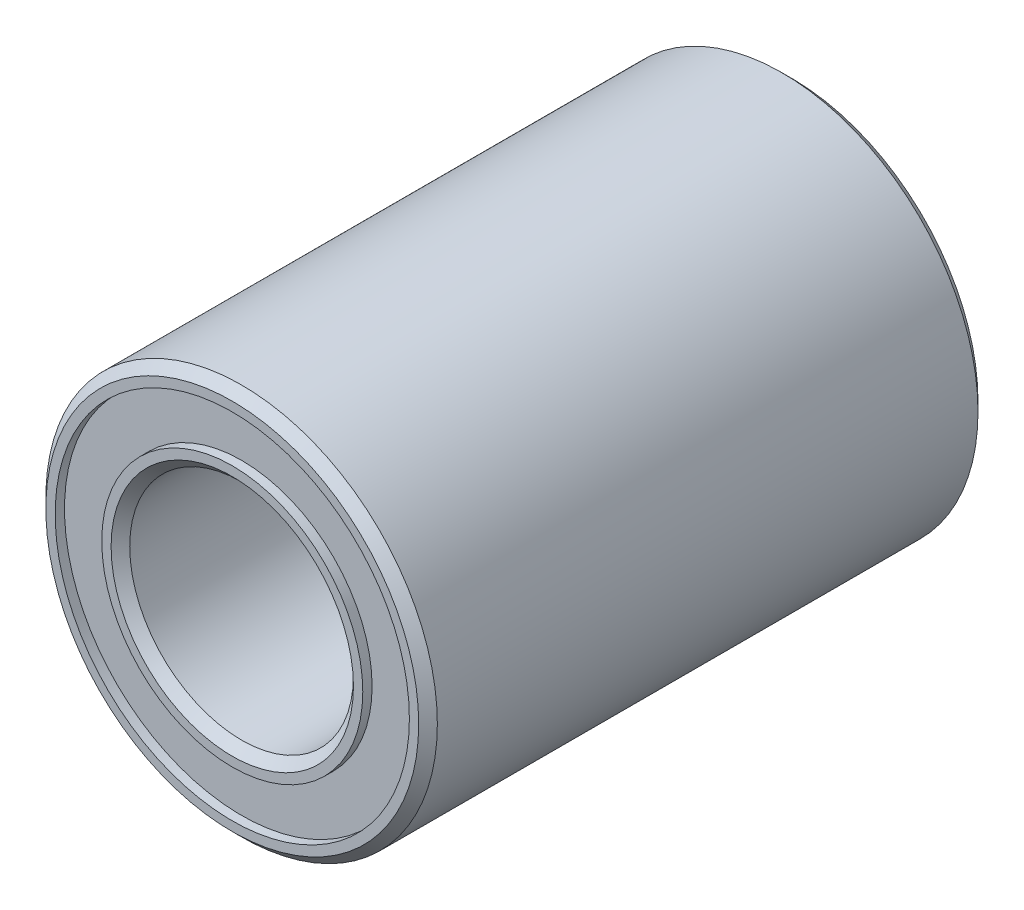
ISO-10303-21;
HEADER;
FILE_DESCRIPTION(('STEP AP214'),'2;1');
FILE_NAME('part.step','',(''),(''),'','','');
FILE_SCHEMA(('AUTOMOTIVE_DESIGN { 1 0 10303 214 1 1 1 1 }'));
ENDSEC;
DATA;
#1=APPLICATION_CONTEXT('core data for automotive mechanical design processes');
#2=APPLICATION_PROTOCOL_DEFINITION('international standard','automotive_design',2000,#1);
#3=PRODUCT_CONTEXT('',#1,'mechanical');
#4=PRODUCT('Part','Part','',(#3));
#5=PRODUCT_RELATED_PRODUCT_CATEGORY('part','',(#4));
#6=PRODUCT_DEFINITION_FORMATION('','',#4);
#7=PRODUCT_DEFINITION_CONTEXT('part definition',#1,'design');
#8=PRODUCT_DEFINITION('design','',#6,#7);
#9=PRODUCT_DEFINITION_SHAPE('','',#8);
#10=(LENGTH_UNIT() NAMED_UNIT(*) SI_UNIT(.MILLI.,.METRE.));
#11=(NAMED_UNIT(*) PLANE_ANGLE_UNIT() SI_UNIT($,.RADIAN.));
#12=(NAMED_UNIT(*) SI_UNIT($,.STERADIAN.) SOLID_ANGLE_UNIT());
#13=UNCERTAINTY_MEASURE_WITH_UNIT(LENGTH_MEASURE(1.E-05),#10,'distance_accuracy_value','');
#14=(GEOMETRIC_REPRESENTATION_CONTEXT(3) GLOBAL_UNCERTAINTY_ASSIGNED_CONTEXT((#13)) GLOBAL_UNIT_ASSIGNED_CONTEXT((#10,
#11,#12)) REPRESENTATION_CONTEXT('',''));
#15=CARTESIAN_POINT('',(0.,0.,0.));
#16=DIRECTION('',(0.,0.,1.));
#17=DIRECTION('',(1.,0.,0.));
#18=AXIS2_PLACEMENT_3D('',#15,#16,#17);
#19=CARTESIAN_POINT('',(0.,0.,0.));
#20=DIRECTION('',(0.,0.,1.));
#21=DIRECTION('',(1.,0.,0.));
#22=AXIS2_PLACEMENT_3D('',#19,#20,#21);
#23=PLANE('',#22);
#24=CARTESIAN_POINT('',(0.,0.,0.));
#25=DIRECTION('',(0.,0.,1.));
#26=DIRECTION('',(1.,0.,0.));
#27=AXIS2_PLACEMENT_3D('',#24,#25,#26);
#28=CIRCLE('',#27,6.5);
#29=CARTESIAN_POINT('',(6.5,0.,0.));
#30=VERTEX_POINT('',#29);
#31=EDGE_CURVE('E61',#30,#30,#28,.T.);
#32=ORIENTED_EDGE('',*,*,#31,.T.);
#33=EDGE_LOOP('',(#32));
#34=FACE_BOUND('',#33,.T.);
#35=CARTESIAN_POINT('',(0.,0.,0.));
#36=DIRECTION('',(0.,0.,-1.));
#37=DIRECTION('',(-1.,0.,0.));
#38=AXIS2_PLACEMENT_3D('',#35,#36,#37);
#39=CIRCLE('',#38,7.);
#40=CARTESIAN_POINT('',(-7.,0.,0.));
#41=VERTEX_POINT('',#40);
#42=EDGE_CURVE('E83',#41,#41,#39,.T.);
#43=ORIENTED_EDGE('',*,*,#42,.T.);
#44=EDGE_LOOP('',(#43));
#45=FACE_BOUND('',#44,.T.);
#46=ADVANCED_FACE('F32',(#34,#45),#23,.F.);
#47=CARTESIAN_POINT('',(0.,0.,30.));
#48=DIRECTION('',(0.,0.,1.));
#49=DIRECTION('',(1.,0.,0.));
#50=AXIS2_PLACEMENT_3D('',#47,#48,#49);
#51=PLANE('',#50);
#52=CARTESIAN_POINT('',(0.,0.,30.));
#53=DIRECTION('',(0.,0.,1.));
#54=DIRECTION('',(1.,0.,0.));
#55=AXIS2_PLACEMENT_3D('',#52,#53,#54);
#56=CIRCLE('',#55,6.5);
#57=CARTESIAN_POINT('',(6.5,0.,30.));
#58=VERTEX_POINT('',#57);
#59=EDGE_CURVE('E52',#58,#58,#56,.F.);
#60=ORIENTED_EDGE('',*,*,#59,.T.);
#61=EDGE_LOOP('',(#60));
#62=FACE_BOUND('',#61,.T.);
#63=CARTESIAN_POINT('',(0.,0.,30.));
#64=DIRECTION('',(0.,0.,1.));
#65=DIRECTION('',(1.,0.,0.));
#66=AXIS2_PLACEMENT_3D('',#63,#64,#65);
#67=CIRCLE('',#66,7.);
#68=CARTESIAN_POINT('',(7.,0.,30.));
#69=VERTEX_POINT('',#68);
#70=EDGE_CURVE('E71',#69,#69,#67,.T.);
#71=ORIENTED_EDGE('',*,*,#70,.T.);
#72=EDGE_LOOP('',(#71));
#73=FACE_BOUND('',#72,.T.);
#74=ADVANCED_FACE('F117',(#62,#73),#51,.T.);
#75=CARTESIAN_POINT('',(0.,0.,30.));
#76=DIRECTION('',(0.,0.,1.));
#77=DIRECTION('',(1.,0.,0.));
#78=AXIS2_PLACEMENT_3D('',#75,#76,#77);
#79=CIRCLE('',#78,10.);
#80=CARTESIAN_POINT('',(10.,0.,30.));
#81=VERTEX_POINT('',#80);
#82=EDGE_CURVE('E10',#81,#81,#79,.T.);
#83=ORIENTED_EDGE('',*,*,#82,.T.);
#84=EDGE_LOOP('',(#83));
#85=FACE_BOUND('',#84,.T.);
#86=CARTESIAN_POINT('',(0.,0.,30.));
#87=DIRECTION('',(0.,0.,1.));
#88=DIRECTION('',(1.,0.,0.));
#89=AXIS2_PLACEMENT_3D('',#86,#87,#88);
#90=CIRCLE('',#89,9.5);
#91=CARTESIAN_POINT('',(9.5,0.,30.));
#92=VERTEX_POINT('',#91);
#93=EDGE_CURVE('E65',#92,#92,#90,.T.);
#94=ORIENTED_EDGE('',*,*,#93,.F.);
#95=EDGE_LOOP('',(#94));
#96=FACE_BOUND('',#95,.T.);
#97=ADVANCED_FACE('F108',(#85,#96),#51,.T.);
#98=CARTESIAN_POINT('',(0.,0.,0.));
#99=DIRECTION('',(0.,0.,1.));
#100=DIRECTION('',(1.,0.,0.));
#101=AXIS2_PLACEMENT_3D('',#98,#99,#100);
#102=CIRCLE('',#101,10.);
#103=CARTESIAN_POINT('',(10.,0.,0.));
#104=VERTEX_POINT('',#103);
#105=EDGE_CURVE('E39',#104,#104,#102,.F.);
#106=ORIENTED_EDGE('',*,*,#105,.T.);
#107=EDGE_LOOP('',(#106));
#108=FACE_BOUND('',#107,.T.);
#109=CARTESIAN_POINT('',(0.,0.,0.));
#110=DIRECTION('',(0.,0.,-1.));
#111=DIRECTION('',(-1.,0.,0.));
#112=AXIS2_PLACEMENT_3D('',#109,#110,#111);
#113=CIRCLE('',#112,9.5);
#114=CARTESIAN_POINT('',(-9.5,0.,0.));
#115=VERTEX_POINT('',#114);
#116=EDGE_CURVE('E77',#115,#115,#113,.T.);
#117=ORIENTED_EDGE('',*,*,#116,.F.);
#118=EDGE_LOOP('',(#117));
#119=FACE_BOUND('',#118,.T.);
#120=ADVANCED_FACE('F105',(#108,#119),#23,.F.);
#121=CARTESIAN_POINT('',(0.,0.,30.));
#122=DIRECTION('',(0.,0.,-1.));
#123=DIRECTION('',(-1.,0.,0.));
#124=AXIS2_PLACEMENT_3D('',#121,#122,#123);
#125=CYLINDRICAL_SURFACE('',#124,10.5);
#126=CARTESIAN_POINT('',(0.,0.,0.5));
#127=DIRECTION('',(0.,0.,1.));
#128=DIRECTION('',(1.,0.,0.));
#129=AXIS2_PLACEMENT_3D('',#126,#127,#128);
#130=CIRCLE('',#129,10.5);
#131=CARTESIAN_POINT('',(10.5,0.,0.5));
#132=VERTEX_POINT('',#131);
#133=EDGE_CURVE('E43',#132,#132,#130,.T.);
#134=ORIENTED_EDGE('',*,*,#133,.T.);
#135=EDGE_LOOP('',(#134));
#136=FACE_BOUND('',#135,.T.);
#137=CARTESIAN_POINT('',(0.,0.,29.5));
#138=DIRECTION('',(0.,0.,1.));
#139=DIRECTION('',(1.,0.,0.));
#140=AXIS2_PLACEMENT_3D('',#137,#138,#139);
#141=CIRCLE('',#140,10.5);
#142=CARTESIAN_POINT('',(10.5,0.,29.5));
#143=VERTEX_POINT('',#142);
#144=EDGE_CURVE('E47',#143,#143,#141,.F.);
#145=ORIENTED_EDGE('',*,*,#144,.T.);
#146=EDGE_LOOP('',(#145));
#147=FACE_BOUND('',#146,.T.);
#148=ADVANCED_FACE('F107',(#136,#147),#125,.T.);
#149=CARTESIAN_POINT('',(0.,0.,30.));
#150=DIRECTION('',(0.,0.,-1.));
#151=DIRECTION('',(-1.,0.,0.));
#152=AXIS2_PLACEMENT_3D('',#149,#150,#151);
#153=CYLINDRICAL_SURFACE('',#152,6.);
#154=CARTESIAN_POINT('',(0.,0.,0.499999999999994));
#155=DIRECTION('',(0.,0.,1.));
#156=DIRECTION('',(1.,0.,0.));
#157=AXIS2_PLACEMENT_3D('',#154,#155,#156);
#158=CIRCLE('',#157,6.);
#159=CARTESIAN_POINT('',(6.,0.,0.499999999999994));
#160=VERTEX_POINT('',#159);
#161=EDGE_CURVE('E55',#160,#160,#158,.F.);
#162=ORIENTED_EDGE('',*,*,#161,.T.);
#163=EDGE_LOOP('',(#162));
#164=FACE_BOUND('',#163,.T.);
#165=CARTESIAN_POINT('',(0.,0.,29.5));
#166=DIRECTION('',(0.,0.,1.));
#167=DIRECTION('',(1.,0.,0.));
#168=AXIS2_PLACEMENT_3D('',#165,#166,#167);
#169=CIRCLE('',#168,6.);
#170=CARTESIAN_POINT('',(6.,0.,29.5));
#171=VERTEX_POINT('',#170);
#172=EDGE_CURVE('E58',#171,#171,#169,.T.);
#173=ORIENTED_EDGE('',*,*,#172,.T.);
#174=EDGE_LOOP('',(#173));
#175=FACE_BOUND('',#174,.T.);
#176=ADVANCED_FACE('F114',(#164,#175),#153,.F.);
#177=CARTESIAN_POINT('',(0.,0.,29.5));
#178=DIRECTION('',(0.,0.,1.));
#179=DIRECTION('',(1.,0.,0.));
#180=AXIS2_PLACEMENT_3D('',#177,#178,#179);
#181=CYLINDRICAL_SURFACE('',#180,9.5);
#182=CARTESIAN_POINT('',(0.,0.,29.5));
#183=DIRECTION('',(0.,0.,1.));
#184=DIRECTION('',(1.,0.,0.));
#185=AXIS2_PLACEMENT_3D('',#182,#183,#184);
#186=CIRCLE('',#185,9.5);
#187=CARTESIAN_POINT('',(9.5,0.,29.5));
#188=VERTEX_POINT('',#187);
#189=EDGE_CURVE('E64',#188,#188,#186,.T.);
#190=ORIENTED_EDGE('',*,*,#189,.F.);
#191=EDGE_LOOP('',(#190));
#192=FACE_BOUND('',#191,.T.);
#193=ORIENTED_EDGE('',*,*,#93,.T.);
#194=EDGE_LOOP('',(#193));
#195=FACE_BOUND('',#194,.T.);
#196=ADVANCED_FACE('F144',(#192,#195),#181,.F.);
#197=CARTESIAN_POINT('',(0.,0.,29.5));
#198=DIRECTION('',(0.,0.,1.));
#199=DIRECTION('',(1.,0.,0.));
#200=AXIS2_PLACEMENT_3D('',#197,#198,#199);
#201=PLANE('',#200);
#202=CARTESIAN_POINT('',(0.,0.,29.5));
#203=DIRECTION('',(0.,0.,1.));
#204=DIRECTION('',(1.,0.,0.));
#205=AXIS2_PLACEMENT_3D('',#202,#203,#204);
#206=CIRCLE('',#205,7.);
#207=CARTESIAN_POINT('',(7.,0.,29.5));
#208=VERTEX_POINT('',#207);
#209=EDGE_CURVE('E68',#208,#208,#206,.T.);
#210=ORIENTED_EDGE('',*,*,#209,.F.);
#211=EDGE_LOOP('',(#210));
#212=FACE_BOUND('',#211,.T.);
#213=ORIENTED_EDGE('',*,*,#189,.T.);
#214=EDGE_LOOP('',(#213));
#215=FACE_BOUND('',#214,.T.);
#216=ADVANCED_FACE('F140',(#212,#215),#201,.T.);
#217=CARTESIAN_POINT('',(0.,0.,29.5));
#218=DIRECTION('',(0.,0.,1.));
#219=DIRECTION('',(1.,0.,0.));
#220=AXIS2_PLACEMENT_3D('',#217,#218,#219);
#221=CYLINDRICAL_SURFACE('',#220,7.);
#222=ORIENTED_EDGE('',*,*,#209,.T.);
#223=EDGE_LOOP('',(#222));
#224=FACE_BOUND('',#223,.T.);
#225=ORIENTED_EDGE('',*,*,#70,.F.);
#226=EDGE_LOOP('',(#225));
#227=FACE_BOUND('',#226,.T.);
#228=ADVANCED_FACE('F101',(#224,#227),#221,.T.);
#229=CARTESIAN_POINT('',(0.,0.,0.5));
#230=DIRECTION('',(0.,0.,-1.));
#231=DIRECTION('',(-1.,0.,0.));
#232=AXIS2_PLACEMENT_3D('',#229,#230,#231);
#233=CYLINDRICAL_SURFACE('',#232,9.5);
#234=CARTESIAN_POINT('',(0.,0.,0.5));
#235=DIRECTION('',(0.,0.,-1.));
#236=DIRECTION('',(-1.,0.,0.));
#237=AXIS2_PLACEMENT_3D('',#234,#235,#236);
#238=CIRCLE('',#237,9.5);
#239=CARTESIAN_POINT('',(-9.5,0.,0.5));
#240=VERTEX_POINT('',#239);
#241=EDGE_CURVE('E74',#240,#240,#238,.T.);
#242=ORIENTED_EDGE('',*,*,#241,.F.);
#243=EDGE_LOOP('',(#242));
#244=FACE_BOUND('',#243,.T.);
#245=ORIENTED_EDGE('',*,*,#116,.T.);
#246=EDGE_LOOP('',(#245));
#247=FACE_BOUND('',#246,.T.);
#248=ADVANCED_FACE('F95',(#244,#247),#233,.F.);
#249=CARTESIAN_POINT('',(0.,0.,0.5));
#250=DIRECTION('',(0.,0.,-1.));
#251=DIRECTION('',(-1.,0.,0.));
#252=AXIS2_PLACEMENT_3D('',#249,#250,#251);
#253=PLANE('',#252);
#254=CARTESIAN_POINT('',(0.,0.,0.5));
#255=DIRECTION('',(0.,0.,-1.));
#256=DIRECTION('',(-1.,0.,0.));
#257=AXIS2_PLACEMENT_3D('',#254,#255,#256);
#258=CIRCLE('',#257,7.);
#259=CARTESIAN_POINT('',(-7.,0.,0.5));
#260=VERTEX_POINT('',#259);
#261=EDGE_CURVE('E80',#260,#260,#258,.T.);
#262=ORIENTED_EDGE('',*,*,#261,.F.);
#263=EDGE_LOOP('',(#262));
#264=FACE_BOUND('',#263,.T.);
#265=ORIENTED_EDGE('',*,*,#241,.T.);
#266=EDGE_LOOP('',(#265));
#267=FACE_BOUND('',#266,.T.);
#268=ADVANCED_FACE('F92',(#264,#267),#253,.T.);
#269=CARTESIAN_POINT('',(0.,0.,0.5));
#270=DIRECTION('',(0.,0.,-1.));
#271=DIRECTION('',(-1.,0.,0.));
#272=AXIS2_PLACEMENT_3D('',#269,#270,#271);
#273=CYLINDRICAL_SURFACE('',#272,7.);
#274=ORIENTED_EDGE('',*,*,#261,.T.);
#275=EDGE_LOOP('',(#274));
#276=FACE_BOUND('',#275,.T.);
#277=ORIENTED_EDGE('',*,*,#42,.F.);
#278=EDGE_LOOP('',(#277));
#279=FACE_BOUND('',#278,.T.);
#280=ADVANCED_FACE('F89',(#276,#279),#273,.T.);
#281=CARTESIAN_POINT('',(0.,0.,0.));
#282=DIRECTION('',(0.,0.,-1.));
#283=DIRECTION('',(-1.,0.,0.));
#284=AXIS2_PLACEMENT_3D('',#281,#282,#283);
#285=CONICAL_SURFACE('',#284,6.5,0.785398163397449);
#286=ORIENTED_EDGE('',*,*,#161,.F.);
#287=EDGE_LOOP('',(#286));
#288=FACE_BOUND('',#287,.T.);
#289=ORIENTED_EDGE('',*,*,#31,.F.);
#290=EDGE_LOOP('',(#289));
#291=FACE_BOUND('',#290,.T.);
#292=ADVANCED_FACE('F129',(#288,#291),#285,.F.);
#293=CARTESIAN_POINT('',(0.,0.,29.5));
#294=DIRECTION('',(0.,0.,1.));
#295=DIRECTION('',(1.,0.,0.));
#296=AXIS2_PLACEMENT_3D('',#293,#294,#295);
#297=CONICAL_SURFACE('',#296,6.,0.78539816339745);
#298=ORIENTED_EDGE('',*,*,#59,.F.);
#299=EDGE_LOOP('',(#298));
#300=FACE_BOUND('',#299,.T.);
#301=ORIENTED_EDGE('',*,*,#172,.F.);
#302=EDGE_LOOP('',(#301));
#303=FACE_BOUND('',#302,.T.);
#304=ADVANCED_FACE('F134',(#300,#303),#297,.F.);
#305=CARTESIAN_POINT('',(0.,0.,0.5));
#306=DIRECTION('',(0.,0.,1.));
#307=DIRECTION('',(1.,0.,0.));
#308=AXIS2_PLACEMENT_3D('',#305,#306,#307);
#309=CONICAL_SURFACE('',#308,10.5,0.785398163397452);
#310=ORIENTED_EDGE('',*,*,#105,.F.);
#311=EDGE_LOOP('',(#310));
#312=FACE_BOUND('',#311,.T.);
#313=ORIENTED_EDGE('',*,*,#133,.F.);
#314=EDGE_LOOP('',(#313));
#315=FACE_BOUND('',#314,.T.);
#316=ADVANCED_FACE('F158',(#312,#315),#309,.T.);
#317=CARTESIAN_POINT('',(0.,0.,30.));
#318=DIRECTION('',(0.,0.,-1.));
#319=DIRECTION('',(-1.,0.,0.));
#320=AXIS2_PLACEMENT_3D('',#317,#318,#319);
#321=CONICAL_SURFACE('',#320,10.,0.785398163397445);
#322=ORIENTED_EDGE('',*,*,#144,.F.);
#323=EDGE_LOOP('',(#322));
#324=FACE_BOUND('',#323,.T.);
#325=ORIENTED_EDGE('',*,*,#82,.F.);
#326=EDGE_LOOP('',(#325));
#327=FACE_BOUND('',#326,.T.);
#328=ADVANCED_FACE('F34',(#324,#327),#321,.T.);
#329=CLOSED_SHELL('',(#46,#74,#97,#120,#148,#176,#196,#216,#228,#248,#268,#280,#292,#304,#316,#328));
#330=MANIFOLD_SOLID_BREP('B2',#329);
#331=ADVANCED_BREP_SHAPE_REPRESENTATION('',(#18,#330),#14);
#332=SHAPE_DEFINITION_REPRESENTATION(#9,#331);
ENDSEC;
END-ISO-10303-21;
